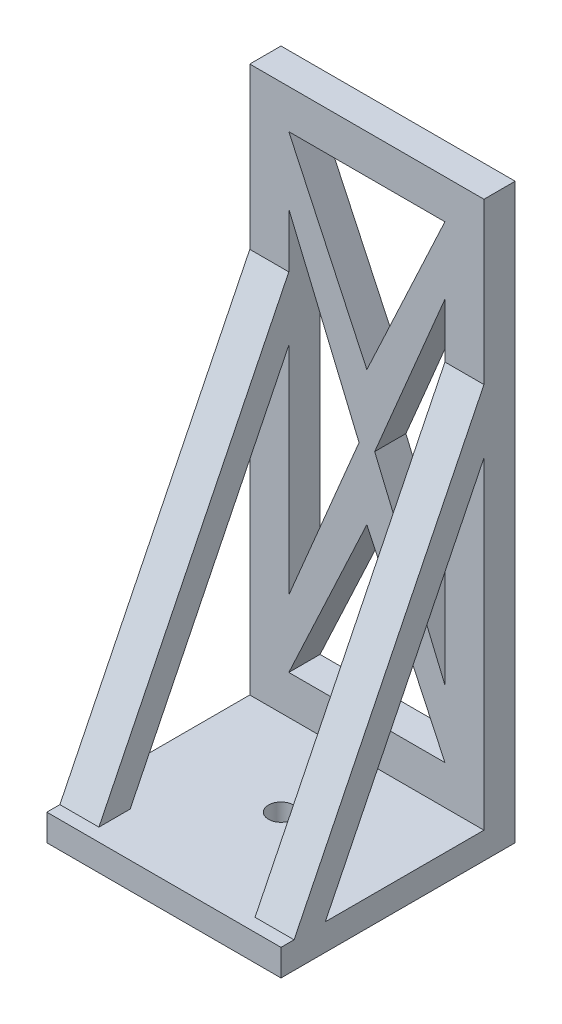
ISO-10303-21;
HEADER;
FILE_DESCRIPTION(('STEP AP214'),'2;1');
FILE_NAME('part.step','',(''),(''),'','','');
FILE_SCHEMA(('AUTOMOTIVE_DESIGN { 1 0 10303 214 1 1 1 1 }'));
ENDSEC;
DATA;
#1=APPLICATION_CONTEXT('core data for automotive mechanical design processes');
#2=APPLICATION_PROTOCOL_DEFINITION('international standard','automotive_design',2000,#1);
#3=PRODUCT_CONTEXT('',#1,'mechanical');
#4=PRODUCT('Part','Part','',(#3));
#5=PRODUCT_RELATED_PRODUCT_CATEGORY('part','',(#4));
#6=PRODUCT_DEFINITION_FORMATION('','',#4);
#7=PRODUCT_DEFINITION_CONTEXT('part definition',#1,'design');
#8=PRODUCT_DEFINITION('design','',#6,#7);
#9=PRODUCT_DEFINITION_SHAPE('','',#8);
#10=(LENGTH_UNIT() NAMED_UNIT(*) SI_UNIT(.MILLI.,.METRE.));
#11=(NAMED_UNIT(*) PLANE_ANGLE_UNIT() SI_UNIT($,.RADIAN.));
#12=(NAMED_UNIT(*) SI_UNIT($,.STERADIAN.) SOLID_ANGLE_UNIT());
#13=UNCERTAINTY_MEASURE_WITH_UNIT(LENGTH_MEASURE(1.E-05),#10,'distance_accuracy_value','');
#14=(GEOMETRIC_REPRESENTATION_CONTEXT(3) GLOBAL_UNCERTAINTY_ASSIGNED_CONTEXT((#13)) GLOBAL_UNIT_ASSIGNED_CONTEXT((#10,
#11,#12)) REPRESENTATION_CONTEXT('',''));
#15=CARTESIAN_POINT('',(0.,0.,0.));
#16=DIRECTION('',(0.,0.,1.));
#17=DIRECTION('',(1.,0.,0.));
#18=AXIS2_PLACEMENT_3D('',#15,#16,#17);
#19=CARTESIAN_POINT('',(0.,3.4,0.));
#20=DIRECTION('',(0.,-1.,0.));
#21=DIRECTION('',(0.,0.,-1.));
#22=AXIS2_PLACEMENT_3D('',#19,#20,#21);
#23=PLANE('',#22);
#24=DIRECTION('',(0.,0.,1.));
#25=VECTOR('',#24,1.);
#26=CARTESIAN_POINT('',(9.99999999999999,3.4,0.));
#27=LINE('',#26,#25);
#28=CARTESIAN_POINT('',(9.99999999999999,3.4,9.3270021998408));
#29=VERTEX_POINT('',#28);
#30=CARTESIAN_POINT('',(9.99999999999999,3.4,13.3270021998408));
#31=VERTEX_POINT('',#30);
#32=EDGE_CURVE('E59',#29,#31,#27,.T.);
#33=ORIENTED_EDGE('',*,*,#32,.F.);
#34=DIRECTION('',(1.,0.,0.));
#35=VECTOR('',#34,1.);
#36=CARTESIAN_POINT('',(0.,3.4,9.3270021998408));
#37=LINE('',#36,#35);
#38=CARTESIAN_POINT('',(15.,3.4,9.3270021998408));
#39=VERTEX_POINT('',#38);
#40=EDGE_CURVE('E63',#29,#39,#37,.T.);
#41=ORIENTED_EDGE('',*,*,#40,.T.);
#42=DIRECTION('',(0.,0.,-1.));
#43=VECTOR('',#42,1.);
#44=CARTESIAN_POINT('',(15.,3.4,15.));
#45=LINE('',#44,#43);
#46=CARTESIAN_POINT('',(15.,3.4,-11.));
#47=VERTEX_POINT('',#46);
#48=EDGE_CURVE('E272',#39,#47,#45,.T.);
#49=ORIENTED_EDGE('',*,*,#48,.T.);
#50=DIRECTION('',(1.,0.,0.));
#51=VECTOR('',#50,1.);
#52=CARTESIAN_POINT('',(-15.,3.4,-11.));
#53=LINE('',#52,#51);
#54=CARTESIAN_POINT('',(-15.,3.4,-11.));
#55=VERTEX_POINT('',#54);
#56=EDGE_CURVE('E254',#55,#47,#53,.T.);
#57=ORIENTED_EDGE('',*,*,#56,.F.);
#58=DIRECTION('',(0.,0.,1.));
#59=VECTOR('',#58,1.);
#60=CARTESIAN_POINT('',(-15.,3.4,15.));
#61=LINE('',#60,#59);
#62=CARTESIAN_POINT('',(-15.,3.4,9.3270021998408));
#63=VERTEX_POINT('',#62);
#64=EDGE_CURVE('E273',#55,#63,#61,.T.);
#65=ORIENTED_EDGE('',*,*,#64,.T.);
#66=DIRECTION('',(1.,0.,0.));
#67=VECTOR('',#66,1.);
#68=CARTESIAN_POINT('',(0.,3.4,9.3270021998408));
#69=LINE('',#68,#67);
#70=CARTESIAN_POINT('',(-10.,3.4,9.3270021998408));
#71=VERTEX_POINT('',#70);
#72=EDGE_CURVE('E388',#63,#71,#69,.T.);
#73=ORIENTED_EDGE('',*,*,#72,.T.);
#74=DIRECTION('',(0.,0.,-1.));
#75=VECTOR('',#74,1.);
#76=CARTESIAN_POINT('',(-10.,3.4,0.));
#77=LINE('',#76,#75);
#78=CARTESIAN_POINT('',(-10.,3.4,13.3270021998408));
#79=VERTEX_POINT('',#78);
#80=EDGE_CURVE('E391',#79,#71,#77,.T.);
#81=ORIENTED_EDGE('',*,*,#80,.F.);
#82=DIRECTION('',(-1.,0.,0.));
#83=VECTOR('',#82,1.);
#84=CARTESIAN_POINT('',(0.,3.4,13.3270021998408));
#85=LINE('',#84,#83);
#86=CARTESIAN_POINT('',(-15.,3.4,13.3270021998408));
#87=VERTEX_POINT('',#86);
#88=EDGE_CURVE('E325',#79,#87,#85,.T.);
#89=ORIENTED_EDGE('',*,*,#88,.T.);
#90=CARTESIAN_POINT('',(-15.,3.4,15.));
#91=VERTEX_POINT('',#90);
#92=EDGE_CURVE('E271',#87,#91,#61,.T.);
#93=ORIENTED_EDGE('',*,*,#92,.T.);
#94=DIRECTION('',(1.,0.,0.));
#95=VECTOR('',#94,1.);
#96=CARTESIAN_POINT('',(-15.,3.4,15.));
#97=LINE('',#96,#95);
#98=CARTESIAN_POINT('',(15.,3.4,15.));
#99=VERTEX_POINT('',#98);
#100=EDGE_CURVE('E276',#91,#99,#97,.T.);
#101=ORIENTED_EDGE('',*,*,#100,.T.);
#102=CARTESIAN_POINT('',(15.,3.4,13.3270021998408));
#103=VERTEX_POINT('',#102);
#104=EDGE_CURVE('E268',#99,#103,#45,.T.);
#105=ORIENTED_EDGE('',*,*,#104,.T.);
#106=DIRECTION('',(-1.,0.,0.));
#107=VECTOR('',#106,1.);
#108=CARTESIAN_POINT('',(0.,3.4,13.3270021998408));
#109=LINE('',#108,#107);
#110=EDGE_CURVE('E221',#103,#31,#109,.T.);
#111=ORIENTED_EDGE('',*,*,#110,.T.);
#112=EDGE_LOOP('',(#33,#41,#49,#57,#65,#73,#81,#89,#93,#101,#105,#111));
#113=FACE_BOUND('',#112,.T.);
#114=CARTESIAN_POINT('',(0.,3.4,0.));
#115=DIRECTION('',(0.,1.,0.));
#116=DIRECTION('',(0.,0.,1.));
#117=AXIS2_PLACEMENT_3D('',#114,#115,#116);
#118=CIRCLE('',#117,1.6);
#119=CARTESIAN_POINT('',(0.,3.4,1.6));
#120=VERTEX_POINT('',#119);
#121=EDGE_CURVE('E260',#120,#120,#118,.T.);
#122=ORIENTED_EDGE('',*,*,#121,.F.);
#123=EDGE_LOOP('',(#122));
#124=FACE_BOUND('',#123,.T.);
#125=ADVANCED_FACE('F43',(#113,#124),#23,.F.);
#126=CARTESIAN_POINT('',(0.,0.,0.));
#127=DIRECTION('',(0.,-1.,0.));
#128=DIRECTION('',(0.,0.,-1.));
#129=AXIS2_PLACEMENT_3D('',#126,#127,#128);
#130=PLANE('',#129);
#131=DIRECTION('',(-1.,0.,0.));
#132=VECTOR('',#131,1.);
#133=CARTESIAN_POINT('',(-15.,0.,-15.));
#134=LINE('',#133,#132);
#135=CARTESIAN_POINT('',(15.,0.,-15.));
#136=VERTEX_POINT('',#135);
#137=CARTESIAN_POINT('',(-15.,0.,-15.));
#138=VERTEX_POINT('',#137);
#139=EDGE_CURVE('E282',#136,#138,#134,.T.);
#140=ORIENTED_EDGE('',*,*,#139,.F.);
#141=DIRECTION('',(0.,0.,-1.));
#142=VECTOR('',#141,1.);
#143=CARTESIAN_POINT('',(15.,0.,15.));
#144=LINE('',#143,#142);
#145=CARTESIAN_POINT('',(15.,0.,15.));
#146=VERTEX_POINT('',#145);
#147=EDGE_CURVE('E264',#146,#136,#144,.T.);
#148=ORIENTED_EDGE('',*,*,#147,.F.);
#149=DIRECTION('',(1.,0.,0.));
#150=VECTOR('',#149,1.);
#151=CARTESIAN_POINT('',(-15.,0.,15.));
#152=LINE('',#151,#150);
#153=CARTESIAN_POINT('',(-15.,0.,15.));
#154=VERTEX_POINT('',#153);
#155=EDGE_CURVE('E289',#154,#146,#152,.T.);
#156=ORIENTED_EDGE('',*,*,#155,.F.);
#157=DIRECTION('',(0.,0.,1.));
#158=VECTOR('',#157,1.);
#159=CARTESIAN_POINT('',(-15.,0.,15.));
#160=LINE('',#159,#158);
#161=EDGE_CURVE('E286',#138,#154,#160,.T.);
#162=ORIENTED_EDGE('',*,*,#161,.F.);
#163=EDGE_LOOP('',(#140,#148,#156,#162));
#164=FACE_BOUND('',#163,.T.);
#165=CARTESIAN_POINT('',(0.,0.,0.));
#166=DIRECTION('',(0.,1.,0.));
#167=DIRECTION('',(0.,0.,1.));
#168=AXIS2_PLACEMENT_3D('',#165,#166,#167);
#169=CIRCLE('',#168,1.6);
#170=CARTESIAN_POINT('',(0.,0.,1.6));
#171=VERTEX_POINT('',#170);
#172=EDGE_CURVE('E259',#171,#171,#169,.T.);
#173=ORIENTED_EDGE('',*,*,#172,.T.);
#174=EDGE_LOOP('',(#173));
#175=FACE_BOUND('',#174,.T.);
#176=ADVANCED_FACE('F317',(#164,#175),#130,.T.);
#177=CARTESIAN_POINT('',(15.,3.4,15.));
#178=DIRECTION('',(-1.,0.,0.));
#179=DIRECTION('',(0.,0.,1.));
#180=AXIS2_PLACEMENT_3D('',#177,#178,#179);
#181=PLANE('',#180);
#182=ORIENTED_EDGE('',*,*,#48,.F.);
#183=DIRECTION('',(0.,0.897259374116077,-0.441503811490713));
#184=VECTOR('',#183,1.);
#185=CARTESIAN_POINT('',(15.,52.8392804769902,-15.));
#186=LINE('',#185,#184);
#187=CARTESIAN_POINT('',(15.,44.7101604036071,-11.));
#188=VERTEX_POINT('',#187);
#189=EDGE_CURVE('E226',#39,#188,#186,.T.);
#190=ORIENTED_EDGE('',*,*,#189,.T.);
#191=DIRECTION('',(0.,-1.,0.));
#192=VECTOR('',#191,1.);
#193=CARTESIAN_POINT('',(15.,73.4,-11.));
#194=LINE('',#193,#192);
#195=EDGE_CURVE('E245',#188,#47,#194,.T.);
#196=ORIENTED_EDGE('',*,*,#195,.T.);
#197=EDGE_LOOP('',(#182,#190,#196));
#198=FACE_BOUND('',#197,.T.);
#199=CARTESIAN_POINT('',(15.,73.4,-11.));
#200=VERTEX_POINT('',#199);
#201=CARTESIAN_POINT('',(15.,52.8392804769902,-11.));
#202=VERTEX_POINT('',#201);
#203=EDGE_CURVE('E234',#200,#202,#194,.T.);
#204=ORIENTED_EDGE('',*,*,#203,.T.);
#205=DIRECTION('',(0.,-0.897259374116077,0.441503811490713));
#206=VECTOR('',#205,1.);
#207=CARTESIAN_POINT('',(15.,52.8392804769902,-11.));
#208=LINE('',#207,#206);
#209=EDGE_CURVE('E215',#202,#103,#208,.T.);
#210=ORIENTED_EDGE('',*,*,#209,.T.);
#211=ORIENTED_EDGE('',*,*,#104,.F.);
#212=DIRECTION('',(0.,-1.,0.));
#213=VECTOR('',#212,1.);
#214=CARTESIAN_POINT('',(15.,3.4,15.));
#215=LINE('',#214,#213);
#216=EDGE_CURVE('E279',#99,#146,#215,.T.);
#217=ORIENTED_EDGE('',*,*,#216,.T.);
#218=ORIENTED_EDGE('',*,*,#147,.T.);
#219=DIRECTION('',(0.,-1.,0.));
#220=VECTOR('',#219,1.);
#221=CARTESIAN_POINT('',(15.,3.4,-15.));
#222=LINE('',#221,#220);
#223=CARTESIAN_POINT('',(15.,73.4,-15.));
#224=VERTEX_POINT('',#223);
#225=EDGE_CURVE('E11',#224,#136,#222,.T.);
#226=ORIENTED_EDGE('',*,*,#225,.F.);
#227=DIRECTION('',(0.,0.,-1.));
#228=VECTOR('',#227,1.);
#229=CARTESIAN_POINT('',(15.,73.4,-15.));
#230=LINE('',#229,#228);
#231=EDGE_CURVE('E242',#200,#224,#230,.T.);
#232=ORIENTED_EDGE('',*,*,#231,.F.);
#233=EDGE_LOOP('',(#204,#210,#211,#217,#218,#226,#232));
#234=FACE_BOUND('',#233,.T.);
#235=ADVANCED_FACE('F45',(#198,#234),#181,.F.);
#236=CARTESIAN_POINT('',(-15.,3.4,-15.));
#237=DIRECTION('',(0.,0.,1.));
#238=DIRECTION('',(1.,0.,0.));
#239=AXIS2_PLACEMENT_3D('',#236,#237,#238);
#240=PLANE('',#239);
#241=DIRECTION('',(-0.387593384716883,0.921830444346307,0.));
#242=VECTOR('',#241,1.);
#243=CARTESIAN_POINT('',(0.999999999999997,38.4,-15.));
#244=LINE('',#243,#242);
#245=CARTESIAN_POINT('',(9.99999999999999,16.9949029930505,-15.));
#246=VERTEX_POINT('',#245);
#247=CARTESIAN_POINT('',(0.999999999999996,38.4,-15.));
#248=VERTEX_POINT('',#247);
#249=EDGE_CURVE('E430',#246,#248,#244,.T.);
#250=ORIENTED_EDGE('',*,*,#249,.F.);
#251=DIRECTION('',(0.,-1.,0.));
#252=VECTOR('',#251,1.);
#253=CARTESIAN_POINT('',(9.99999999999999,16.9949029930505,-15.));
#254=LINE('',#253,#252);
#255=CARTESIAN_POINT('',(9.99999999999999,59.8050970069495,-15.));
#256=VERTEX_POINT('',#255);
#257=EDGE_CURVE('E461',#256,#246,#254,.T.);
#258=ORIENTED_EDGE('',*,*,#257,.F.);
#259=DIRECTION('',(0.387593384716883,0.921830444346307,0.));
#260=VECTOR('',#259,1.);
#261=CARTESIAN_POINT('',(9.99999999999999,59.8050970069495,-15.));
#262=LINE('',#261,#260);
#263=EDGE_CURVE('E457',#248,#256,#262,.T.);
#264=ORIENTED_EDGE('',*,*,#263,.F.);
#265=EDGE_LOOP('',(#250,#258,#264));
#266=FACE_BOUND('',#265,.T.);
#267=ORIENTED_EDGE('',*,*,#139,.T.);
#268=DIRECTION('',(0.,-1.,0.));
#269=VECTOR('',#268,1.);
#270=CARTESIAN_POINT('',(-15.,3.4,-15.));
#271=LINE('',#270,#269);
#272=CARTESIAN_POINT('',(-15.,73.4,-15.));
#273=VERTEX_POINT('',#272);
#274=EDGE_CURVE('E52',#273,#138,#271,.T.);
#275=ORIENTED_EDGE('',*,*,#274,.F.);
#276=DIRECTION('',(-1.,0.,0.));
#277=VECTOR('',#276,1.);
#278=CARTESIAN_POINT('',(-15.,73.4,-15.));
#279=LINE('',#278,#277);
#280=EDGE_CURVE('E252',#224,#273,#279,.T.);
#281=ORIENTED_EDGE('',*,*,#280,.F.);
#282=ORIENTED_EDGE('',*,*,#225,.T.);
#283=EDGE_LOOP('',(#267,#275,#281,#282));
#284=FACE_BOUND('',#283,.T.);
#285=DIRECTION('',(0.,1.,0.));
#286=VECTOR('',#285,1.);
#287=CARTESIAN_POINT('',(-10.,59.8050970069495,-15.));
#288=LINE('',#287,#286);
#289=CARTESIAN_POINT('',(-10.,16.9949029930505,-15.));
#290=VERTEX_POINT('',#289);
#291=CARTESIAN_POINT('',(-10.,59.8050970069495,-15.));
#292=VERTEX_POINT('',#291);
#293=EDGE_CURVE('E435',#290,#292,#288,.T.);
#294=ORIENTED_EDGE('',*,*,#293,.F.);
#295=DIRECTION('',(-0.387593384716883,-0.921830444346307,0.));
#296=VECTOR('',#295,1.);
#297=CARTESIAN_POINT('',(-10.,16.9949029930505,-15.));
#298=LINE('',#297,#296);
#299=CARTESIAN_POINT('',(-1.,38.4,-15.));
#300=VERTEX_POINT('',#299);
#301=EDGE_CURVE('E490',#300,#290,#298,.T.);
#302=ORIENTED_EDGE('',*,*,#301,.F.);
#303=DIRECTION('',(0.387593384716883,-0.921830444346307,0.));
#304=VECTOR('',#303,1.);
#305=CARTESIAN_POINT('',(-1.,38.4,-15.));
#306=LINE('',#305,#304);
#307=EDGE_CURVE('E429',#292,#300,#306,.T.);
#308=ORIENTED_EDGE('',*,*,#307,.F.);
#309=EDGE_LOOP('',(#294,#302,#308));
#310=FACE_BOUND('',#309,.T.);
#311=DIRECTION('',(-1.,0.,0.));
#312=VECTOR('',#311,1.);
#313=CARTESIAN_POINT('',(-10.,8.4,-15.));
#314=LINE('',#313,#312);
#315=CARTESIAN_POINT('',(9.99999999999999,8.4,-15.));
#316=VERTEX_POINT('',#315);
#317=CARTESIAN_POINT('',(-10.,8.4,-15.));
#318=VERTEX_POINT('',#317);
#319=EDGE_CURVE('E426',#316,#318,#314,.T.);
#320=ORIENTED_EDGE('',*,*,#319,.F.);
#321=DIRECTION('',(0.423266184399698,-0.906005373683689,0.));
#322=VECTOR('',#321,1.);
#323=CARTESIAN_POINT('',(0.,29.8050970069495,-15.));
#324=LINE('',#323,#322);
#325=CARTESIAN_POINT('',(0.,29.8050970069495,-15.));
#326=VERTEX_POINT('',#325);
#327=EDGE_CURVE('E422',#326,#316,#324,.T.);
#328=ORIENTED_EDGE('',*,*,#327,.F.);
#329=DIRECTION('',(0.423266184399698,0.906005373683689,0.));
#330=VECTOR('',#329,1.);
#331=CARTESIAN_POINT('',(0.,29.8050970069495,-15.));
#332=LINE('',#331,#330);
#333=EDGE_CURVE('E397',#318,#326,#332,.T.);
#334=ORIENTED_EDGE('',*,*,#333,.F.);
#335=EDGE_LOOP('',(#320,#328,#334));
#336=FACE_BOUND('',#335,.T.);
#337=DIRECTION('',(-0.423266184399698,-0.906005373683689,0.));
#338=VECTOR('',#337,1.);
#339=CARTESIAN_POINT('',(0.,46.9949029930505,-15.));
#340=LINE('',#339,#338);
#341=CARTESIAN_POINT('',(9.99999999999999,68.4,-15.));
#342=VERTEX_POINT('',#341);
#343=CARTESIAN_POINT('',(0.,46.9949029930505,-15.));
#344=VERTEX_POINT('',#343);
#345=EDGE_CURVE('E464',#342,#344,#340,.T.);
#346=ORIENTED_EDGE('',*,*,#345,.F.);
#347=DIRECTION('',(1.,0.,0.));
#348=VECTOR('',#347,1.);
#349=CARTESIAN_POINT('',(9.99999999999999,68.4,-15.));
#350=LINE('',#349,#348);
#351=CARTESIAN_POINT('',(-10.,68.4,-15.));
#352=VERTEX_POINT('',#351);
#353=EDGE_CURVE('E498',#352,#342,#350,.T.);
#354=ORIENTED_EDGE('',*,*,#353,.F.);
#355=DIRECTION('',(-0.423266184399698,0.906005373683689,0.));
#356=VECTOR('',#355,1.);
#357=CARTESIAN_POINT('',(-10.,68.4,-15.));
#358=LINE('',#357,#356);
#359=EDGE_CURVE('E339',#344,#352,#358,.T.);
#360=ORIENTED_EDGE('',*,*,#359,.F.);
#361=EDGE_LOOP('',(#346,#354,#360));
#362=FACE_BOUND('',#361,.T.);
#363=ADVANCED_FACE('F312',(#266,#284,#310,#336,#362),#240,.F.);
#364=CARTESIAN_POINT('',(-15.,3.4,15.));
#365=DIRECTION('',(1.,0.,0.));
#366=DIRECTION('',(0.,0.,-1.));
#367=AXIS2_PLACEMENT_3D('',#364,#365,#366);
#368=PLANE('',#367);
#369=DIRECTION('',(0.,-0.897259374116076,0.441503811490713));
#370=VECTOR('',#369,1.);
#371=CARTESIAN_POINT('',(-15.,52.8392804769902,-15.));
#372=LINE('',#371,#370);
#373=CARTESIAN_POINT('',(-15.,44.7101604036071,-11.));
#374=VERTEX_POINT('',#373);
#375=EDGE_CURVE('E373',#374,#63,#372,.T.);
#376=ORIENTED_EDGE('',*,*,#375,.T.);
#377=ORIENTED_EDGE('',*,*,#64,.F.);
#378=DIRECTION('',(0.,-1.,0.));
#379=VECTOR('',#378,1.);
#380=CARTESIAN_POINT('',(-15.,73.4,-11.));
#381=LINE('',#380,#379);
#382=EDGE_CURVE('E244',#374,#55,#381,.T.);
#383=ORIENTED_EDGE('',*,*,#382,.F.);
#384=EDGE_LOOP('',(#376,#377,#383));
#385=FACE_BOUND('',#384,.T.);
#386=ORIENTED_EDGE('',*,*,#92,.F.);
#387=DIRECTION('',(0.,0.897259374116077,-0.441503811490713));
#388=VECTOR('',#387,1.);
#389=CARTESIAN_POINT('',(-15.,52.8392804769902,-11.));
#390=LINE('',#389,#388);
#391=CARTESIAN_POINT('',(-15.,52.8392804769902,-11.));
#392=VERTEX_POINT('',#391);
#393=EDGE_CURVE('E370',#87,#392,#390,.T.);
#394=ORIENTED_EDGE('',*,*,#393,.T.);
#395=CARTESIAN_POINT('',(-15.,73.4,-11.));
#396=VERTEX_POINT('',#395);
#397=EDGE_CURVE('E249',#396,#392,#381,.T.);
#398=ORIENTED_EDGE('',*,*,#397,.F.);
#399=DIRECTION('',(0.,0.,1.));
#400=VECTOR('',#399,1.);
#401=CARTESIAN_POINT('',(-15.,73.4,-15.));
#402=LINE('',#401,#400);
#403=EDGE_CURVE('E307',#273,#396,#402,.T.);
#404=ORIENTED_EDGE('',*,*,#403,.F.);
#405=ORIENTED_EDGE('',*,*,#274,.T.);
#406=ORIENTED_EDGE('',*,*,#161,.T.);
#407=DIRECTION('',(0.,-1.,0.));
#408=VECTOR('',#407,1.);
#409=CARTESIAN_POINT('',(-15.,3.4,15.));
#410=LINE('',#409,#408);
#411=EDGE_CURVE('E295',#91,#154,#410,.T.);
#412=ORIENTED_EDGE('',*,*,#411,.F.);
#413=EDGE_LOOP('',(#386,#394,#398,#404,#405,#406,#412));
#414=FACE_BOUND('',#413,.T.);
#415=ADVANCED_FACE('F302',(#385,#414),#368,.F.);
#416=CARTESIAN_POINT('',(-15.,3.4,15.));
#417=DIRECTION('',(0.,0.,-1.));
#418=DIRECTION('',(-1.,0.,0.));
#419=AXIS2_PLACEMENT_3D('',#416,#417,#418);
#420=PLANE('',#419);
#421=ORIENTED_EDGE('',*,*,#155,.T.);
#422=ORIENTED_EDGE('',*,*,#216,.F.);
#423=ORIENTED_EDGE('',*,*,#100,.F.);
#424=ORIENTED_EDGE('',*,*,#411,.T.);
#425=EDGE_LOOP('',(#421,#422,#423,#424));
#426=FACE_BOUND('',#425,.T.);
#427=ADVANCED_FACE('F321',(#426),#420,.F.);
#428=CARTESIAN_POINT('',(0.,3.4,0.));
#429=DIRECTION('',(0.,-1.,0.));
#430=DIRECTION('',(0.,0.,-1.));
#431=AXIS2_PLACEMENT_3D('',#428,#429,#430);
#432=CYLINDRICAL_SURFACE('',#431,1.6);
#433=ORIENTED_EDGE('',*,*,#121,.T.);
#434=EDGE_LOOP('',(#433));
#435=FACE_BOUND('',#434,.T.);
#436=ORIENTED_EDGE('',*,*,#172,.F.);
#437=EDGE_LOOP('',(#436));
#438=FACE_BOUND('',#437,.T.);
#439=ADVANCED_FACE('F541',(#435,#438),#432,.F.);
#440=CARTESIAN_POINT('',(-15.,73.4,-11.));
#441=DIRECTION('',(0.,0.,-1.));
#442=DIRECTION('',(-1.,0.,0.));
#443=AXIS2_PLACEMENT_3D('',#440,#441,#442);
#444=PLANE('',#443);
#445=ORIENTED_EDGE('',*,*,#195,.F.);
#446=DIRECTION('',(-1.,0.,0.));
#447=VECTOR('',#446,1.);
#448=CARTESIAN_POINT('',(-15.,44.7101604036071,-11.));
#449=LINE('',#448,#447);
#450=CARTESIAN_POINT('',(9.99999999999999,44.7101604036071,-11.));
#451=VERTEX_POINT('',#450);
#452=EDGE_CURVE('E827',#188,#451,#449,.T.);
#453=ORIENTED_EDGE('',*,*,#452,.T.);
#454=DIRECTION('',(0.,1.,0.));
#455=VECTOR('',#454,1.);
#456=CARTESIAN_POINT('',(9.99999999999999,16.9949029930505,-11.));
#457=LINE('',#456,#455);
#458=CARTESIAN_POINT('',(9.99999999999999,16.9949029930505,-11.));
#459=VERTEX_POINT('',#458);
#460=EDGE_CURVE('E446',#459,#451,#457,.T.);
#461=ORIENTED_EDGE('',*,*,#460,.F.);
#462=DIRECTION('',(0.387593384716883,-0.921830444346307,0.));
#463=VECTOR('',#462,1.);
#464=CARTESIAN_POINT('',(0.999999999999997,38.4,-11.));
#465=LINE('',#464,#463);
#466=CARTESIAN_POINT('',(0.999999999999994,38.4,-11.));
#467=VERTEX_POINT('',#466);
#468=EDGE_CURVE('E450',#467,#459,#465,.T.);
#469=ORIENTED_EDGE('',*,*,#468,.F.);
#470=DIRECTION('',(-0.387593384716883,-0.921830444346307,0.));
#471=VECTOR('',#470,1.);
#472=CARTESIAN_POINT('',(9.99999999999999,59.8050970069495,-11.));
#473=LINE('',#472,#471);
#474=CARTESIAN_POINT('',(9.99999999999999,59.8050970069495,-11.));
#475=VERTEX_POINT('',#474);
#476=EDGE_CURVE('E454',#475,#467,#473,.T.);
#477=ORIENTED_EDGE('',*,*,#476,.F.);
#478=CARTESIAN_POINT('',(9.99999999999999,52.8392804769902,-11.));
#479=VERTEX_POINT('',#478);
#480=EDGE_CURVE('E237',#479,#475,#457,.T.);
#481=ORIENTED_EDGE('',*,*,#480,.F.);
#482=DIRECTION('',(1.,0.,0.));
#483=VECTOR('',#482,1.);
#484=CARTESIAN_POINT('',(-50.7617442255079,52.8392804769902,-11.));
#485=LINE('',#484,#483);
#486=EDGE_CURVE('E219',#479,#202,#485,.T.);
#487=ORIENTED_EDGE('',*,*,#486,.T.);
#488=ORIENTED_EDGE('',*,*,#203,.F.);
#489=DIRECTION('',(1.,0.,0.));
#490=VECTOR('',#489,1.);
#491=CARTESIAN_POINT('',(-15.,73.4,-11.));
#492=LINE('',#491,#490);
#493=EDGE_CURVE('E342',#396,#200,#492,.T.);
#494=ORIENTED_EDGE('',*,*,#493,.F.);
#495=ORIENTED_EDGE('',*,*,#397,.T.);
#496=DIRECTION('',(-1.,0.,0.));
#497=VECTOR('',#496,1.);
#498=CARTESIAN_POINT('',(50.7617442255079,52.8392804769902,-11.));
#499=LINE('',#498,#497);
#500=CARTESIAN_POINT('',(-10.,52.8392804769902,-11.));
#501=VERTEX_POINT('',#500);
#502=EDGE_CURVE('E368',#501,#392,#499,.T.);
#503=ORIENTED_EDGE('',*,*,#502,.F.);
#504=DIRECTION('',(0.,-1.,0.));
#505=VECTOR('',#504,1.);
#506=CARTESIAN_POINT('',(-10.,59.8050970069495,-11.));
#507=LINE('',#506,#505);
#508=CARTESIAN_POINT('',(-10.,59.8050970069495,-11.));
#509=VERTEX_POINT('',#508);
#510=EDGE_CURVE('E480',#509,#501,#507,.T.);
#511=ORIENTED_EDGE('',*,*,#510,.F.);
#512=DIRECTION('',(-0.387593384716883,0.921830444346307,0.));
#513=VECTOR('',#512,1.);
#514=CARTESIAN_POINT('',(-1.,38.4,-11.));
#515=LINE('',#514,#513);
#516=CARTESIAN_POINT('',(-1.,38.4,-11.));
#517=VERTEX_POINT('',#516);
#518=EDGE_CURVE('E483',#517,#509,#515,.T.);
#519=ORIENTED_EDGE('',*,*,#518,.F.);
#520=DIRECTION('',(0.387593384716883,0.921830444346307,0.));
#521=VECTOR('',#520,1.);
#522=CARTESIAN_POINT('',(-10.,16.9949029930505,-11.));
#523=LINE('',#522,#521);
#524=CARTESIAN_POINT('',(-10.,16.9949029930505,-11.));
#525=VERTEX_POINT('',#524);
#526=EDGE_CURVE('E487',#525,#517,#523,.T.);
#527=ORIENTED_EDGE('',*,*,#526,.F.);
#528=CARTESIAN_POINT('',(-10.,44.7101604036071,-11.));
#529=VERTEX_POINT('',#528);
#530=EDGE_CURVE('E473',#529,#525,#507,.T.);
#531=ORIENTED_EDGE('',*,*,#530,.F.);
#532=DIRECTION('',(-1.,0.,0.));
#533=VECTOR('',#532,1.);
#534=CARTESIAN_POINT('',(-15.,44.7101604036071,-11.));
#535=LINE('',#534,#533);
#536=EDGE_CURVE('E385',#529,#374,#535,.T.);
#537=ORIENTED_EDGE('',*,*,#536,.T.);
#538=ORIENTED_EDGE('',*,*,#382,.T.);
#539=ORIENTED_EDGE('',*,*,#56,.T.);
#540=EDGE_LOOP('',(#445,#453,#461,#469,#477,#481,#487,#488,#494,#495,#503,#511,#519,#527,#531,
#537,#538,#539));
#541=FACE_BOUND('',#540,.T.);
#542=DIRECTION('',(-0.423266184399698,-0.906005373683689,0.));
#543=VECTOR('',#542,1.);
#544=CARTESIAN_POINT('',(0.,29.8050970069495,-11.));
#545=LINE('',#544,#543);
#546=CARTESIAN_POINT('',(0.,29.8050970069495,-11.));
#547=VERTEX_POINT('',#546);
#548=CARTESIAN_POINT('',(-10.,8.4,-11.));
#549=VERTEX_POINT('',#548);
#550=EDGE_CURVE('E415',#547,#549,#545,.T.);
#551=ORIENTED_EDGE('',*,*,#550,.F.);
#552=DIRECTION('',(-0.423266184399698,0.906005373683689,0.));
#553=VECTOR('',#552,1.);
#554=CARTESIAN_POINT('',(0.,29.8050970069495,-11.));
#555=LINE('',#554,#553);
#556=CARTESIAN_POINT('',(9.99999999999999,8.4,-11.));
#557=VERTEX_POINT('',#556);
#558=EDGE_CURVE('E419',#557,#547,#555,.T.);
#559=ORIENTED_EDGE('',*,*,#558,.F.);
#560=DIRECTION('',(1.,0.,0.));
#561=VECTOR('',#560,1.);
#562=CARTESIAN_POINT('',(-10.,8.4,-11.));
#563=LINE('',#562,#561);
#564=EDGE_CURVE('E406',#549,#557,#563,.T.);
#565=ORIENTED_EDGE('',*,*,#564,.F.);
#566=EDGE_LOOP('',(#551,#559,#565));
#567=FACE_BOUND('',#566,.T.);
#568=DIRECTION('',(0.423266184399698,-0.906005373683689,0.));
#569=VECTOR('',#568,1.);
#570=CARTESIAN_POINT('',(-10.,68.4,-11.));
#571=LINE('',#570,#569);
#572=CARTESIAN_POINT('',(-10.,68.4,-11.));
#573=VERTEX_POINT('',#572);
#574=CARTESIAN_POINT('',(0.,46.9949029930505,-11.));
#575=VERTEX_POINT('',#574);
#576=EDGE_CURVE('E505',#573,#575,#571,.T.);
#577=ORIENTED_EDGE('',*,*,#576,.F.);
#578=DIRECTION('',(-1.,0.,0.));
#579=VECTOR('',#578,1.);
#580=CARTESIAN_POINT('',(9.99999999999999,68.4,-11.));
#581=LINE('',#580,#579);
#582=CARTESIAN_POINT('',(9.99999999999999,68.4,-11.));
#583=VERTEX_POINT('',#582);
#584=EDGE_CURVE('E502',#583,#573,#581,.T.);
#585=ORIENTED_EDGE('',*,*,#584,.F.);
#586=DIRECTION('',(0.423266184399698,0.906005373683689,0.));
#587=VECTOR('',#586,1.);
#588=CARTESIAN_POINT('',(0.,46.9949029930505,-11.));
#589=LINE('',#588,#587);
#590=EDGE_CURVE('E509',#575,#583,#589,.T.);
#591=ORIENTED_EDGE('',*,*,#590,.F.);
#592=EDGE_LOOP('',(#577,#585,#591));
#593=FACE_BOUND('',#592,.T.);
#594=ADVANCED_FACE('F232',(#541,#567,#593),#444,.F.);
#595=CARTESIAN_POINT('',(0.,73.4,0.));
#596=DIRECTION('',(0.,1.,0.));
#597=DIRECTION('',(0.,0.,1.));
#598=AXIS2_PLACEMENT_3D('',#595,#596,#597);
#599=PLANE('',#598);
#600=ORIENTED_EDGE('',*,*,#403,.T.);
#601=ORIENTED_EDGE('',*,*,#493,.T.);
#602=ORIENTED_EDGE('',*,*,#231,.T.);
#603=ORIENTED_EDGE('',*,*,#280,.T.);
#604=EDGE_LOOP('',(#600,#601,#602,#603));
#605=FACE_BOUND('',#604,.T.);
#606=ADVANCED_FACE('F364',(#605),#599,.T.);
#607=CARTESIAN_POINT('',(9.99999999999999,68.4,-15.001));
#608=DIRECTION('',(0.,1.,0.));
#609=DIRECTION('',(0.,0.,1.));
#610=AXIS2_PLACEMENT_3D('',#607,#608,#609);
#611=PLANE('',#610);
#612=ORIENTED_EDGE('',*,*,#353,.T.);
#613=DIRECTION('',(0.,0.,1.));
#614=VECTOR('',#613,1.);
#615=CARTESIAN_POINT('',(9.99999999999999,68.4,-15.001));
#616=LINE('',#615,#614);
#617=EDGE_CURVE('E345',#342,#583,#616,.T.);
#618=ORIENTED_EDGE('',*,*,#617,.T.);
#619=ORIENTED_EDGE('',*,*,#584,.T.);
#620=DIRECTION('',(0.,0.,1.));
#621=VECTOR('',#620,1.);
#622=CARTESIAN_POINT('',(-10.,68.4,-15.001));
#623=LINE('',#622,#621);
#624=EDGE_CURVE('E356',#352,#573,#623,.T.);
#625=ORIENTED_EDGE('',*,*,#624,.F.);
#626=EDGE_LOOP('',(#612,#618,#619,#625));
#627=FACE_BOUND('',#626,.T.);
#628=ADVANCED_FACE('F523',(#627),#611,.F.);
#629=CARTESIAN_POINT('',(0.,46.9949029930505,-15.001));
#630=DIRECTION('',(0.906005373683689,-0.423266184399698,0.));
#631=DIRECTION('',(0.423266184399698,0.906005373683689,0.));
#632=AXIS2_PLACEMENT_3D('',#629,#630,#631);
#633=PLANE('',#632);
#634=ORIENTED_EDGE('',*,*,#345,.T.);
#635=DIRECTION('',(0.,0.,1.));
#636=VECTOR('',#635,1.);
#637=CARTESIAN_POINT('',(0.,46.9949029930505,-15.001));
#638=LINE('',#637,#636);
#639=EDGE_CURVE('E353',#344,#575,#638,.T.);
#640=ORIENTED_EDGE('',*,*,#639,.T.);
#641=ORIENTED_EDGE('',*,*,#590,.T.);
#642=ORIENTED_EDGE('',*,*,#617,.F.);
#643=EDGE_LOOP('',(#634,#640,#641,#642));
#644=FACE_BOUND('',#643,.T.);
#645=ADVANCED_FACE('F521',(#644),#633,.F.);
#646=CARTESIAN_POINT('',(-10.,68.4,-15.001));
#647=DIRECTION('',(-0.906005373683689,-0.423266184399698,0.));
#648=DIRECTION('',(0.423266184399698,-0.906005373683689,0.));
#649=AXIS2_PLACEMENT_3D('',#646,#647,#648);
#650=PLANE('',#649);
#651=ORIENTED_EDGE('',*,*,#359,.T.);
#652=ORIENTED_EDGE('',*,*,#624,.T.);
#653=ORIENTED_EDGE('',*,*,#576,.T.);
#654=ORIENTED_EDGE('',*,*,#639,.F.);
#655=EDGE_LOOP('',(#651,#652,#653,#654));
#656=FACE_BOUND('',#655,.T.);
#657=ADVANCED_FACE('F516',(#656),#650,.F.);
#658=CARTESIAN_POINT('',(0.,29.8050970069495,-15.001));
#659=DIRECTION('',(0.906005373683689,0.423266184399698,0.));
#660=DIRECTION('',(-0.423266184399698,0.906005373683689,0.));
#661=AXIS2_PLACEMENT_3D('',#658,#659,#660);
#662=PLANE('',#661);
#663=ORIENTED_EDGE('',*,*,#327,.T.);
#664=DIRECTION('',(0.,0.,1.));
#665=VECTOR('',#664,1.);
#666=CARTESIAN_POINT('',(9.99999999999999,8.4,-15.001));
#667=LINE('',#666,#665);
#668=EDGE_CURVE('E401',#316,#557,#667,.T.);
#669=ORIENTED_EDGE('',*,*,#668,.T.);
#670=ORIENTED_EDGE('',*,*,#558,.T.);
#671=DIRECTION('',(0.,0.,1.));
#672=VECTOR('',#671,1.);
#673=CARTESIAN_POINT('',(0.,29.8050970069495,-15.001));
#674=LINE('',#673,#672);
#675=EDGE_CURVE('E402',#326,#547,#674,.T.);
#676=ORIENTED_EDGE('',*,*,#675,.F.);
#677=EDGE_LOOP('',(#663,#669,#670,#676));
#678=FACE_BOUND('',#677,.T.);
#679=ADVANCED_FACE('F564',(#678),#662,.F.);
#680=CARTESIAN_POINT('',(-10.,8.4,-15.001));
#681=DIRECTION('',(0.,-1.,0.));
#682=DIRECTION('',(0.,0.,-1.));
#683=AXIS2_PLACEMENT_3D('',#680,#681,#682);
#684=PLANE('',#683);
#685=ORIENTED_EDGE('',*,*,#319,.T.);
#686=DIRECTION('',(0.,0.,1.));
#687=VECTOR('',#686,1.);
#688=CARTESIAN_POINT('',(-10.,8.4,-15.001));
#689=LINE('',#688,#687);
#690=EDGE_CURVE('E407',#318,#549,#689,.T.);
#691=ORIENTED_EDGE('',*,*,#690,.T.);
#692=ORIENTED_EDGE('',*,*,#564,.T.);
#693=ORIENTED_EDGE('',*,*,#668,.F.);
#694=EDGE_LOOP('',(#685,#691,#692,#693));
#695=FACE_BOUND('',#694,.T.);
#696=ADVANCED_FACE('F592',(#695),#684,.F.);
#697=CARTESIAN_POINT('',(0.,29.8050970069495,-15.001));
#698=DIRECTION('',(-0.906005373683689,0.423266184399698,0.));
#699=DIRECTION('',(-0.423266184399698,-0.906005373683689,0.));
#700=AXIS2_PLACEMENT_3D('',#697,#698,#699);
#701=PLANE('',#700);
#702=ORIENTED_EDGE('',*,*,#333,.T.);
#703=ORIENTED_EDGE('',*,*,#675,.T.);
#704=ORIENTED_EDGE('',*,*,#550,.T.);
#705=ORIENTED_EDGE('',*,*,#690,.F.);
#706=EDGE_LOOP('',(#702,#703,#704,#705));
#707=FACE_BOUND('',#706,.T.);
#708=ADVANCED_FACE('F579',(#707),#701,.F.);
#709=CARTESIAN_POINT('',(-10.,16.9949029930505,-15.001));
#710=DIRECTION('',(0.921830444346307,-0.387593384716883,0.));
#711=DIRECTION('',(0.387593384716883,0.921830444346307,0.));
#712=AXIS2_PLACEMENT_3D('',#709,#710,#711);
#713=PLANE('',#712);
#714=ORIENTED_EDGE('',*,*,#301,.T.);
#715=DIRECTION('',(0.,0.,1.));
#716=VECTOR('',#715,1.);
#717=CARTESIAN_POINT('',(-10.,16.9949029930505,-15.001));
#718=LINE('',#717,#716);
#719=EDGE_CURVE('E468',#290,#525,#718,.T.);
#720=ORIENTED_EDGE('',*,*,#719,.T.);
#721=ORIENTED_EDGE('',*,*,#526,.T.);
#722=DIRECTION('',(0.,0.,1.));
#723=VECTOR('',#722,1.);
#724=CARTESIAN_POINT('',(-1.,38.4,-15.001));
#725=LINE('',#724,#723);
#726=EDGE_CURVE('E469',#300,#517,#725,.T.);
#727=ORIENTED_EDGE('',*,*,#726,.F.);
#728=EDGE_LOOP('',(#714,#720,#721,#727));
#729=FACE_BOUND('',#728,.T.);
#730=ADVANCED_FACE('F571',(#729),#713,.F.);
#731=CARTESIAN_POINT('',(-10.,59.8050970069495,-15.001));
#732=DIRECTION('',(-1.,0.,0.));
#733=DIRECTION('',(0.,0.,1.));
#734=AXIS2_PLACEMENT_3D('',#731,#732,#733);
#735=PLANE('',#734);
#736=ORIENTED_EDGE('',*,*,#510,.T.);
#737=DIRECTION('',(0.,-0.897259374116077,0.441503811490713));
#738=VECTOR('',#737,1.);
#739=CARTESIAN_POINT('',(-10.,52.8392804769902,-11.));
#740=LINE('',#739,#738);
#741=EDGE_CURVE('E377',#501,#79,#740,.T.);
#742=ORIENTED_EDGE('',*,*,#741,.T.);
#743=ORIENTED_EDGE('',*,*,#80,.T.);
#744=DIRECTION('',(0.,0.897259374116076,-0.441503811490713));
#745=VECTOR('',#744,1.);
#746=CARTESIAN_POINT('',(-10.,52.8392804769902,-15.));
#747=LINE('',#746,#745);
#748=EDGE_CURVE('E381',#71,#529,#747,.T.);
#749=ORIENTED_EDGE('',*,*,#748,.T.);
#750=ORIENTED_EDGE('',*,*,#530,.T.);
#751=ORIENTED_EDGE('',*,*,#719,.F.);
#752=ORIENTED_EDGE('',*,*,#293,.T.);
#753=DIRECTION('',(0.,0.,1.));
#754=VECTOR('',#753,1.);
#755=CARTESIAN_POINT('',(-10.,59.8050970069495,-15.001));
#756=LINE('',#755,#754);
#757=EDGE_CURVE('E474',#292,#509,#756,.T.);
#758=ORIENTED_EDGE('',*,*,#757,.T.);
#759=EDGE_LOOP('',(#736,#742,#743,#749,#750,#751,#752,#758));
#760=FACE_BOUND('',#759,.T.);
#761=ADVANCED_FACE('F567',(#760),#735,.F.);
#762=CARTESIAN_POINT('',(-1.,38.4,-15.001));
#763=DIRECTION('',(0.921830444346307,0.387593384716883,0.));
#764=DIRECTION('',(-0.387593384716883,0.921830444346307,0.));
#765=AXIS2_PLACEMENT_3D('',#762,#763,#764);
#766=PLANE('',#765);
#767=ORIENTED_EDGE('',*,*,#307,.T.);
#768=ORIENTED_EDGE('',*,*,#726,.T.);
#769=ORIENTED_EDGE('',*,*,#518,.T.);
#770=ORIENTED_EDGE('',*,*,#757,.F.);
#771=EDGE_LOOP('',(#767,#768,#769,#770));
#772=FACE_BOUND('',#771,.T.);
#773=ADVANCED_FACE('F570',(#772),#766,.F.);
#774=CARTESIAN_POINT('',(9.99999999999999,59.8050970069495,-15.001));
#775=DIRECTION('',(-0.921830444346307,0.387593384716883,0.));
#776=DIRECTION('',(-0.387593384716883,-0.921830444346307,0.));
#777=AXIS2_PLACEMENT_3D('',#774,#775,#776);
#778=PLANE('',#777);
#779=ORIENTED_EDGE('',*,*,#263,.T.);
#780=DIRECTION('',(0.,0.,1.));
#781=VECTOR('',#780,1.);
#782=CARTESIAN_POINT('',(9.99999999999999,59.8050970069495,-15.001));
#783=LINE('',#782,#781);
#784=EDGE_CURVE('E434',#256,#475,#783,.T.);
#785=ORIENTED_EDGE('',*,*,#784,.T.);
#786=ORIENTED_EDGE('',*,*,#476,.T.);
#787=DIRECTION('',(0.,0.,1.));
#788=VECTOR('',#787,1.);
#789=CARTESIAN_POINT('',(0.999999999999997,38.4,-15.001));
#790=LINE('',#789,#788);
#791=EDGE_CURVE('E436',#248,#467,#790,.T.);
#792=ORIENTED_EDGE('',*,*,#791,.F.);
#793=EDGE_LOOP('',(#779,#785,#786,#792));
#794=FACE_BOUND('',#793,.T.);
#795=ADVANCED_FACE('F575',(#794),#778,.F.);
#796=CARTESIAN_POINT('',(9.99999999999999,16.9949029930505,-15.001));
#797=DIRECTION('',(1.,0.,0.));
#798=DIRECTION('',(0.,0.,-1.));
#799=AXIS2_PLACEMENT_3D('',#796,#797,#798);
#800=PLANE('',#799);
#801=ORIENTED_EDGE('',*,*,#257,.T.);
#802=DIRECTION('',(0.,0.,1.));
#803=VECTOR('',#802,1.);
#804=CARTESIAN_POINT('',(9.99999999999999,16.9949029930505,-15.001));
#805=LINE('',#804,#803);
#806=EDGE_CURVE('E440',#246,#459,#805,.T.);
#807=ORIENTED_EDGE('',*,*,#806,.T.);
#808=ORIENTED_EDGE('',*,*,#460,.T.);
#809=DIRECTION('',(0.,-0.897259374116077,0.441503811490713));
#810=VECTOR('',#809,1.);
#811=CARTESIAN_POINT('',(9.99999999999999,52.8392804769902,-15.));
#812=LINE('',#811,#810);
#813=EDGE_CURVE('E825',#451,#29,#812,.T.);
#814=ORIENTED_EDGE('',*,*,#813,.T.);
#815=ORIENTED_EDGE('',*,*,#32,.T.);
#816=DIRECTION('',(0.,0.897259374116077,-0.441503811490713));
#817=VECTOR('',#816,1.);
#818=CARTESIAN_POINT('',(9.99999999999999,52.8392804769902,-11.));
#819=LINE('',#818,#817);
#820=EDGE_CURVE('E239',#31,#479,#819,.T.);
#821=ORIENTED_EDGE('',*,*,#820,.T.);
#822=ORIENTED_EDGE('',*,*,#480,.T.);
#823=ORIENTED_EDGE('',*,*,#784,.F.);
#824=EDGE_LOOP('',(#801,#807,#808,#814,#815,#821,#822,#823));
#825=FACE_BOUND('',#824,.T.);
#826=ADVANCED_FACE('F581',(#825),#800,.F.);
#827=CARTESIAN_POINT('',(0.999999999999997,38.4,-15.001));
#828=DIRECTION('',(-0.921830444346307,-0.387593384716883,0.));
#829=DIRECTION('',(0.387593384716883,-0.921830444346307,0.));
#830=AXIS2_PLACEMENT_3D('',#827,#828,#829);
#831=PLANE('',#830);
#832=ORIENTED_EDGE('',*,*,#249,.T.);
#833=ORIENTED_EDGE('',*,*,#791,.T.);
#834=ORIENTED_EDGE('',*,*,#468,.T.);
#835=ORIENTED_EDGE('',*,*,#806,.F.);
#836=EDGE_LOOP('',(#832,#833,#834,#835));
#837=FACE_BOUND('',#836,.T.);
#838=ADVANCED_FACE('F584',(#837),#831,.F.);
#839=CARTESIAN_POINT('',(50.7617442255079,52.8392804769902,-11.));
#840=DIRECTION('',(0.,0.441503811490713,0.897259374116076));
#841=DIRECTION('',(0.,-0.897259374116077,0.441503811490713));
#842=AXIS2_PLACEMENT_3D('',#839,#840,#841);
#843=PLANE('',#842);
#844=ORIENTED_EDGE('',*,*,#88,.F.);
#845=ORIENTED_EDGE('',*,*,#741,.F.);
#846=ORIENTED_EDGE('',*,*,#502,.T.);
#847=ORIENTED_EDGE('',*,*,#393,.F.);
#848=EDGE_LOOP('',(#844,#845,#846,#847));
#849=FACE_BOUND('',#848,.T.);
#850=ADVANCED_FACE('F375',(#849),#843,.T.);
#851=CARTESIAN_POINT('',(50.7617442255079,52.8392804769902,-15.));
#852=DIRECTION('',(0.,-0.441503811490712,-0.897259374116076));
#853=DIRECTION('',(0.,0.897259374116076,-0.441503811490713));
#854=AXIS2_PLACEMENT_3D('',#851,#852,#853);
#855=PLANE('',#854);
#856=ORIENTED_EDGE('',*,*,#72,.F.);
#857=ORIENTED_EDGE('',*,*,#375,.F.);
#858=ORIENTED_EDGE('',*,*,#536,.F.);
#859=ORIENTED_EDGE('',*,*,#748,.F.);
#860=EDGE_LOOP('',(#856,#857,#858,#859));
#861=FACE_BOUND('',#860,.T.);
#862=ADVANCED_FACE('F602',(#861),#855,.T.);
#863=CARTESIAN_POINT('',(-50.7617442255079,52.8392804769902,-11.));
#864=DIRECTION('',(0.,0.441503811490713,0.897259374116076));
#865=DIRECTION('',(0.,-0.897259374116077,0.441503811490713));
#866=AXIS2_PLACEMENT_3D('',#863,#864,#865);
#867=PLANE('',#866);
#868=ORIENTED_EDGE('',*,*,#110,.F.);
#869=ORIENTED_EDGE('',*,*,#209,.F.);
#870=ORIENTED_EDGE('',*,*,#486,.F.);
#871=ORIENTED_EDGE('',*,*,#820,.F.);
#872=EDGE_LOOP('',(#868,#869,#870,#871));
#873=FACE_BOUND('',#872,.T.);
#874=ADVANCED_FACE('F217',(#873),#867,.T.);
#875=CARTESIAN_POINT('',(-50.7617442255079,52.8392804769902,-15.));
#876=DIRECTION('',(0.,-0.441503811490713,-0.897259374116076));
#877=DIRECTION('',(0.,0.897259374116077,-0.441503811490713));
#878=AXIS2_PLACEMENT_3D('',#875,#876,#877);
#879=PLANE('',#878);
#880=ORIENTED_EDGE('',*,*,#40,.F.);
#881=ORIENTED_EDGE('',*,*,#813,.F.);
#882=ORIENTED_EDGE('',*,*,#452,.F.);
#883=ORIENTED_EDGE('',*,*,#189,.F.);
#884=EDGE_LOOP('',(#880,#881,#882,#883));
#885=FACE_BOUND('',#884,.T.);
#886=ADVANCED_FACE('F608',(#885),#879,.T.);
#887=CLOSED_SHELL('',(#125,#176,#235,#363,#415,#427,#439,#594,#606,#628,#645,#657,#679,#696,
#708,#730,#761,#773,#795,#826,#838,#850,#862,#874,#886));
#888=MANIFOLD_SOLID_BREP('B2',#887);
#889=ADVANCED_BREP_SHAPE_REPRESENTATION('',(#18,#888),#14);
#890=SHAPE_DEFINITION_REPRESENTATION(#9,#889);
ENDSEC;
END-ISO-10303-21;
